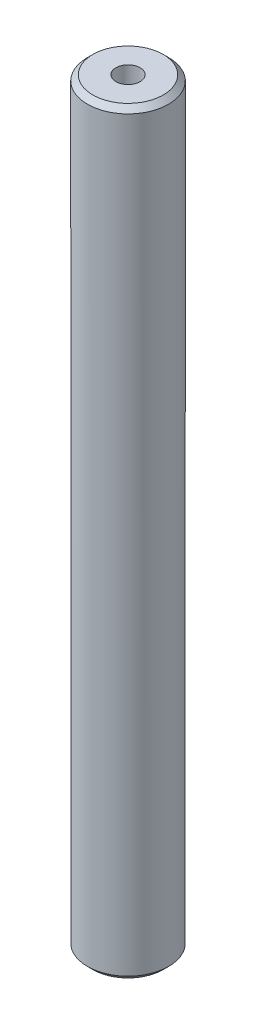
ISO-10303-21;
HEADER;
FILE_DESCRIPTION(('STEP AP214'),'2;1');
FILE_NAME('part.step','',(''),(''),'','','');
FILE_SCHEMA(('AUTOMOTIVE_DESIGN { 1 0 10303 214 1 1 1 1 }'));
ENDSEC;
DATA;
#1=APPLICATION_CONTEXT('core data for automotive mechanical design processes');
#2=APPLICATION_PROTOCOL_DEFINITION('international standard','automotive_design',2000,#1);
#3=PRODUCT_CONTEXT('',#1,'mechanical');
#4=PRODUCT('Part','Part','',(#3));
#5=PRODUCT_RELATED_PRODUCT_CATEGORY('part','',(#4));
#6=PRODUCT_DEFINITION_FORMATION('','',#4);
#7=PRODUCT_DEFINITION_CONTEXT('part definition',#1,'design');
#8=PRODUCT_DEFINITION('design','',#6,#7);
#9=PRODUCT_DEFINITION_SHAPE('','',#8);
#10=(LENGTH_UNIT() NAMED_UNIT(*) SI_UNIT(.MILLI.,.METRE.));
#11=(NAMED_UNIT(*) PLANE_ANGLE_UNIT() SI_UNIT($,.RADIAN.));
#12=(NAMED_UNIT(*) SI_UNIT($,.STERADIAN.) SOLID_ANGLE_UNIT());
#13=UNCERTAINTY_MEASURE_WITH_UNIT(LENGTH_MEASURE(1.E-05),#10,'distance_accuracy_value','');
#14=(GEOMETRIC_REPRESENTATION_CONTEXT(3) GLOBAL_UNCERTAINTY_ASSIGNED_CONTEXT((#13)) GLOBAL_UNIT_ASSIGNED_CONTEXT((#10,
#11,#12)) REPRESENTATION_CONTEXT('',''));
#15=CARTESIAN_POINT('',(0.,0.,0.));
#16=DIRECTION('',(0.,0.,1.));
#17=DIRECTION('',(1.,0.,0.));
#18=AXIS2_PLACEMENT_3D('',#15,#16,#17);
#19=CARTESIAN_POINT('',(0.,420.62093698399,0.));
#20=DIRECTION('',(0.,-1.,0.));
#21=DIRECTION('',(0.,0.,-1.));
#22=AXIS2_PLACEMENT_3D('',#19,#20,#21);
#23=CYLINDRICAL_SURFACE('',#22,22.5);
#24=CARTESIAN_POINT('',(0.,417.652403516235,0.));
#25=DIRECTION('',(0.,1.,0.));
#26=DIRECTION('',(0.,0.,1.));
#27=AXIS2_PLACEMENT_3D('',#24,#25,#26);
#28=CIRCLE('',#27,22.5);
#29=CARTESIAN_POINT('',(0.,417.652403516235,-22.5));
#30=VERTEX_POINT('',#29);
#31=EDGE_CURVE('E50',#30,#30,#28,.F.);
#32=CARTESIAN_POINT('',(0.,2.96853346775539,0.));
#33=DIRECTION('',(0.,1.,0.));
#34=DIRECTION('',(0.,0.,1.));
#35=AXIS2_PLACEMENT_3D('',#32,#33,#34);
#36=CIRCLE('',#35,22.5);
#37=CARTESIAN_POINT('',(0.,2.96853346775533,-22.5));
#38=VERTEX_POINT('',#37);
#39=EDGE_CURVE('E51',#38,#38,#36,.T.);
#40=CARTESIAN_POINT('',(0.,417.652403516235,-22.5));
#41=CARTESIAN_POINT('',(0.,413.332779869896,-22.5));
#42=CARTESIAN_POINT('',(0.,409.013156223558,-22.5));
#43=CARTESIAN_POINT('',(0.,400.373908930882,-22.5));
#44=CARTESIAN_POINT('',(0.,396.054285284543,-22.5));
#45=CARTESIAN_POINT('',(0.,387.415037991867,-22.5));
#46=CARTESIAN_POINT('',(0.,383.095414345528,-22.5));
#47=CARTESIAN_POINT('',(0.,374.456167052852,-22.5));
#48=CARTESIAN_POINT('',(0.,370.136543406513,-22.5));
#49=CARTESIAN_POINT('',(0.,361.497296113837,-22.5));
#50=CARTESIAN_POINT('',(0.,357.177672467498,-22.5));
#51=CARTESIAN_POINT('',(0.,348.538425174822,-22.5));
#52=CARTESIAN_POINT('',(0.,344.218801528483,-22.5));
#53=CARTESIAN_POINT('',(0.,335.579554235807,-22.5));
#54=CARTESIAN_POINT('',(0.,331.259930589468,-22.5));
#55=CARTESIAN_POINT('',(0.,322.620683296792,-22.5));
#56=CARTESIAN_POINT('',(0.,318.301059650453,-22.5));
#57=CARTESIAN_POINT('',(0.,309.661812357777,-22.5));
#58=CARTESIAN_POINT('',(0.,305.342188711438,-22.5));
#59=CARTESIAN_POINT('',(0.,296.702941418762,-22.5));
#60=CARTESIAN_POINT('',(0.,292.383317772423,-22.5));
#61=CARTESIAN_POINT('',(0.,283.744070479747,-22.5));
#62=CARTESIAN_POINT('',(0.,279.424446833408,-22.5));
#63=CARTESIAN_POINT('',(0.,270.785199540732,-22.5));
#64=CARTESIAN_POINT('',(0.,266.465575894393,-22.5));
#65=CARTESIAN_POINT('',(0.,257.826328601717,-22.5));
#66=CARTESIAN_POINT('',(0.,253.506704955378,-22.5));
#67=CARTESIAN_POINT('',(0.,244.867457662702,-22.5));
#68=CARTESIAN_POINT('',(0.,240.547834016363,-22.5));
#69=CARTESIAN_POINT('',(0.,231.908586723687,-22.5));
#70=CARTESIAN_POINT('',(0.,227.588963077348,-22.5));
#71=CARTESIAN_POINT('',(0.,218.949715784672,-22.5));
#72=CARTESIAN_POINT('',(0.,214.630092138333,-22.5));
#73=CARTESIAN_POINT('',(0.,205.990844845657,-22.5));
#74=CARTESIAN_POINT('',(0.,201.671221199318,-22.5));
#75=CARTESIAN_POINT('',(0.,193.031973906642,-22.5));
#76=CARTESIAN_POINT('',(0.,188.712350260303,-22.5));
#77=CARTESIAN_POINT('',(0.,180.073102967627,-22.5));
#78=CARTESIAN_POINT('',(0.,175.753479321288,-22.5));
#79=CARTESIAN_POINT('',(0.,167.114232028612,-22.5));
#80=CARTESIAN_POINT('',(0.,162.794608382273,-22.5));
#81=CARTESIAN_POINT('',(0.,154.155361089597,-22.5));
#82=CARTESIAN_POINT('',(0.,149.835737443258,-22.5));
#83=CARTESIAN_POINT('',(0.,141.196490150582,-22.5));
#84=CARTESIAN_POINT('',(0.,136.876866504243,-22.5));
#85=CARTESIAN_POINT('',(0.,128.237619211567,-22.5));
#86=CARTESIAN_POINT('',(0.,123.917995565228,-22.5));
#87=CARTESIAN_POINT('',(0.,115.278748272552,-22.5));
#88=CARTESIAN_POINT('',(0.,110.959124626214,-22.5));
#89=CARTESIAN_POINT('',(0.,102.319877333537,-22.5));
#90=CARTESIAN_POINT('',(0.,98.0002536871985,-22.5));
#91=CARTESIAN_POINT('',(0.,89.3610063945219,-22.5));
#92=CARTESIAN_POINT('',(0.,85.0413827481836,-22.5));
#93=CARTESIAN_POINT('',(0.,76.4021354555069,-22.5));
#94=CARTESIAN_POINT('',(0.,72.0825118091686,-22.5));
#95=CARTESIAN_POINT('',(0.,63.4432645164919,-22.5));
#96=CARTESIAN_POINT('',(0.,59.1236408701536,-22.5));
#97=CARTESIAN_POINT('',(0.,50.4843935774769,-22.5));
#98=CARTESIAN_POINT('',(0.,46.1647699311386,-22.5));
#99=CARTESIAN_POINT('',(0.,37.5255226384619,-22.5));
#100=CARTESIAN_POINT('',(0.,33.2058989921236,-22.5));
#101=CARTESIAN_POINT('',(0.,24.566651699447,-22.5));
#102=CARTESIAN_POINT('',(0.,20.2470280531086,-22.5));
#103=CARTESIAN_POINT('',(0.,11.607780760432,-22.5));
#104=CARTESIAN_POINT('',(0.,7.28815711409364,-22.5));
#105=CARTESIAN_POINT('',(0.,2.96853346775533,-22.5));
#106=B_SPLINE_CURVE_WITH_KNOTS('',3,(#40,#41,#42,#43,#44,#45,#46,#47,#48,#49,#50,#51,#52,#53,
#54,#55,#56,#57,#58,#59,#60,#61,#62,#63,#64,#65,#66,#67,#68,#69,#70,#71,#72,#73,#74,#75,#76,#77,
#78,#79,#80,#81,#82,#83,#84,#85,#86,#87,#88,#89,#90,#91,#92,#93,#94,#95,#96,#97,#98,#99,#100,
#101,#102,#103,#104,#105),.UNSPECIFIED.,.F.,.F.,(4,2,2,2,2,2,2,2,2,2,2,2,2,2,2,2,2,2,2,2,2,2,2,
2,2,2,2,2,2,2,2,2,4),(0.,12.9588709390149,25.9177418780299,38.8766128170449,51.8354837560599,
64.7943546950749,77.7532256340899,90.7120965731049,103.67096751212,116.629838451135,
129.58870939015,142.547580329165,155.50645126818,168.465322207195,181.42419314621,
194.383064085225,207.34193502424,220.300805963255,233.25967690227,246.218547841285,
259.1774187803,272.136289719315,285.09516065833,298.054031597345,311.01290253636,
323.971773475375,336.93064441439,349.889515353405,362.848386292419,375.807257231435,
388.766128170449,401.724999109465,414.683870048479),.UNSPECIFIED.);
#107=EDGE_CURVE('BSEAM39',#30,#38,#106,.T.);
#108=ORIENTED_EDGE('',*,*,#31,.T.);
#109=ORIENTED_EDGE('',*,*,#39,.T.);
#110=ORIENTED_EDGE('',*,*,#107,.T.);
#111=ORIENTED_EDGE('',*,*,#107,.F.);
#112=EDGE_LOOP('',(#108,#110,#109,#111));
#113=FACE_BOUND('',#112,.T.);
#114=ADVANCED_FACE('F39',(#113),#23,.T.);
#115=CARTESIAN_POINT('',(0.,420.62093698399,0.));
#116=DIRECTION('',(0.,1.,0.));
#117=DIRECTION('',(0.,0.,1.));
#118=AXIS2_PLACEMENT_3D('',#115,#116,#117);
#119=PLANE('',#118);
#120=CARTESIAN_POINT('',(0.,420.62093698399,0.));
#121=DIRECTION('',(0.,1.,0.));
#122=DIRECTION('',(0.,0.,1.));
#123=AXIS2_PLACEMENT_3D('',#120,#121,#122);
#124=CIRCLE('',#123,19.5314665322447);
#125=CARTESIAN_POINT('',(0.,420.62093698399,-19.5314665322447));
#126=VERTEX_POINT('',#125);
#127=EDGE_CURVE('E54',#126,#126,#124,.T.);
#128=ORIENTED_EDGE('',*,*,#127,.T.);
#129=EDGE_LOOP('',(#128));
#130=FACE_BOUND('',#129,.T.);
#131=CARTESIAN_POINT('',(0.,420.62093698399,0.));
#132=DIRECTION('',(0.,1.,0.));
#133=DIRECTION('',(0.,0.,1.));
#134=AXIS2_PLACEMENT_3D('',#131,#132,#133);
#135=CIRCLE('',#134,6.72766516371501);
#136=CARTESIAN_POINT('',(0.,420.62093698399,6.72766516371501));
#137=VERTEX_POINT('',#136);
#138=EDGE_CURVE('E58',#137,#137,#135,.T.);
#139=ORIENTED_EDGE('',*,*,#138,.F.);
#140=EDGE_LOOP('',(#139));
#141=FACE_BOUND('',#140,.T.);
#142=ADVANCED_FACE('F69',(#130,#141),#119,.T.);
#143=CARTESIAN_POINT('',(0.,0.,0.));
#144=DIRECTION('',(0.,1.,0.));
#145=DIRECTION('',(0.,0.,1.));
#146=AXIS2_PLACEMENT_3D('',#143,#144,#145);
#147=PLANE('',#146);
#148=CARTESIAN_POINT('',(0.,0.,0.));
#149=DIRECTION('',(0.,1.,0.));
#150=DIRECTION('',(0.,0.,1.));
#151=AXIS2_PLACEMENT_3D('',#148,#149,#150);
#152=CIRCLE('',#151,19.5314665322447);
#153=CARTESIAN_POINT('',(0.,0.,19.5314665322447));
#154=VERTEX_POINT('',#153);
#155=EDGE_CURVE('E10',#154,#154,#152,.F.);
#156=ORIENTED_EDGE('',*,*,#155,.T.);
#157=EDGE_LOOP('',(#156));
#158=FACE_BOUND('',#157,.T.);
#159=CARTESIAN_POINT('',(0.,0.,0.));
#160=DIRECTION('',(0.,1.,0.));
#161=DIRECTION('',(0.,0.,1.));
#162=AXIS2_PLACEMENT_3D('',#159,#160,#161);
#163=CIRCLE('',#162,6.72766516371501);
#164=CARTESIAN_POINT('',(0.,0.,6.72766516371501));
#165=VERTEX_POINT('',#164);
#166=EDGE_CURVE('E63',#165,#165,#163,.T.);
#167=ORIENTED_EDGE('',*,*,#166,.T.);
#168=EDGE_LOOP('',(#167));
#169=FACE_BOUND('',#168,.T.);
#170=ADVANCED_FACE('F75',(#158,#169),#147,.F.);
#171=CARTESIAN_POINT('',(0.,420.62093698399,0.));
#172=DIRECTION('',(0.,-1.,0.));
#173=DIRECTION('',(0.,0.,-1.));
#174=AXIS2_PLACEMENT_3D('',#171,#172,#173);
#175=CYLINDRICAL_SURFACE('',#174,6.72766516371501);
#176=ORIENTED_EDGE('',*,*,#138,.T.);
#177=EDGE_LOOP('',(#176));
#178=FACE_BOUND('',#177,.T.);
#179=ORIENTED_EDGE('',*,*,#166,.F.);
#180=EDGE_LOOP('',(#179));
#181=FACE_BOUND('',#180,.T.);
#182=ADVANCED_FACE('F70',(#178,#181),#175,.F.);
#183=CARTESIAN_POINT('',(0.,420.62093698399,0.));
#184=DIRECTION('',(0.,-1.,0.));
#185=DIRECTION('',(0.,0.,-1.));
#186=AXIS2_PLACEMENT_3D('',#183,#184,#185);
#187=CONICAL_SURFACE('',#186,19.5314665322447,0.785398163397436);
#188=CARTESIAN_POINT('',(0.,417.652403516235,-22.5));
#189=CARTESIAN_POINT('',(0.,417.683325739857,-22.4690777763776));
#190=CARTESIAN_POINT('',(0.,417.71424796348,-22.4381555527551));
#191=CARTESIAN_POINT('',(0.,417.776092410725,-22.3763111055102));
#192=CARTESIAN_POINT('',(0.,417.807014634347,-22.3453888818878));
#193=CARTESIAN_POINT('',(0.,417.868859081592,-22.2835444346429));
#194=CARTESIAN_POINT('',(0.,417.899781305214,-22.2526222110204));
#195=CARTESIAN_POINT('',(0.,417.961625752459,-22.1907777637755));
#196=CARTESIAN_POINT('',(0.,417.992547976082,-22.1598555401531));
#197=CARTESIAN_POINT('',(0.,418.054392423327,-22.0980110929082));
#198=CARTESIAN_POINT('',(0.,418.085314646949,-22.0670888692857));
#199=CARTESIAN_POINT('',(0.,418.147159094194,-22.0052444220408));
#200=CARTESIAN_POINT('',(0.,418.178081317817,-21.9743221984184));
#201=CARTESIAN_POINT('',(0.,418.239925765061,-21.9124777511735));
#202=CARTESIAN_POINT('',(0.,418.270847988684,-21.881555527551));
#203=CARTESIAN_POINT('',(0.,418.332692435929,-21.8197110803061));
#204=CARTESIAN_POINT('',(0.,418.363614659551,-21.7887888566837));
#205=CARTESIAN_POINT('',(0.,418.425459106796,-21.7269444094388));
#206=CARTESIAN_POINT('',(0.,418.456381330419,-21.6960221858163));
#207=CARTESIAN_POINT('',(0.,418.518225777663,-21.6341777385714));
#208=CARTESIAN_POINT('',(0.,418.549148001286,-21.603255514949));
#209=CARTESIAN_POINT('',(0.,418.610992448531,-21.5414110677041));
#210=CARTESIAN_POINT('',(0.,418.641914672153,-21.5104888440816));
#211=CARTESIAN_POINT('',(0.,418.703759119398,-21.4486443968367));
#212=CARTESIAN_POINT('',(0.,418.734681343021,-21.4177221732142));
#213=CARTESIAN_POINT('',(0.,418.796525790266,-21.3558777259693));
#214=CARTESIAN_POINT('',(0.,418.827448013888,-21.3249555023469));
#215=CARTESIAN_POINT('',(0.,418.889292461133,-21.263111055102));
#216=CARTESIAN_POINT('',(0.,418.920214684755,-21.2321888314795));
#217=CARTESIAN_POINT('',(0.,418.982059132,-21.1703443842346));
#218=CARTESIAN_POINT('',(0.,419.012981355623,-21.1394221606122));
#219=CARTESIAN_POINT('',(0.,419.074825802868,-21.0775777133673));
#220=CARTESIAN_POINT('',(0.,419.10574802649,-21.0466554897448));
#221=CARTESIAN_POINT('',(0.,419.167592473735,-20.9848110424999));
#222=CARTESIAN_POINT('',(0.,419.198514697357,-20.9538888188775));
#223=CARTESIAN_POINT('',(0.,419.260359144602,-20.8920443716326));
#224=CARTESIAN_POINT('',(0.,419.291281368225,-20.8611221480101));
#225=CARTESIAN_POINT('',(0.,419.35312581547,-20.7992777007652));
#226=CARTESIAN_POINT('',(0.,419.384048039092,-20.7683554771428));
#227=CARTESIAN_POINT('',(0.,419.445892486337,-20.7065110298979));
#228=CARTESIAN_POINT('',(0.,419.47681470996,-20.6755888062754));
#229=CARTESIAN_POINT('',(0.,419.538659157204,-20.6137443590305));
#230=CARTESIAN_POINT('',(0.,419.569581380827,-20.5828221354081));
#231=CARTESIAN_POINT('',(0.,419.631425828072,-20.5209776881631));
#232=CARTESIAN_POINT('',(0.,419.662348051694,-20.4900554645407));
#233=CARTESIAN_POINT('',(0.,419.724192498939,-20.4282110172958));
#234=CARTESIAN_POINT('',(0.,419.755114722562,-20.3972887936733));
#235=CARTESIAN_POINT('',(0.,419.816959169806,-20.3354443464284));
#236=CARTESIAN_POINT('',(0.,419.847881393429,-20.304522122806));
#237=CARTESIAN_POINT('',(0.,419.909725840674,-20.2426776755611));
#238=CARTESIAN_POINT('',(0.,419.940648064296,-20.2117554519386));
#239=CARTESIAN_POINT('',(0.,420.002492511541,-20.1499110046937));
#240=CARTESIAN_POINT('',(0.,420.033414735164,-20.1189887810713));
#241=CARTESIAN_POINT('',(0.,420.095259182409,-20.0571443338264));
#242=CARTESIAN_POINT('',(0.,420.126181406031,-20.0262221102039));
#243=CARTESIAN_POINT('',(0.,420.188025853276,-19.964377662959));
#244=CARTESIAN_POINT('',(0.,420.218948076898,-19.9334554393366));
#245=CARTESIAN_POINT('',(0.,420.280792524143,-19.8716109920917));
#246=CARTESIAN_POINT('',(0.,420.311714747766,-19.8406887684692));
#247=CARTESIAN_POINT('',(0.,420.373559195011,-19.7788443212243));
#248=CARTESIAN_POINT('',(0.,420.404481418633,-19.7479220976019));
#249=CARTESIAN_POINT('',(0.,420.466325865878,-19.686077650357));
#250=CARTESIAN_POINT('',(0.,420.4972480895,-19.6551554267345));
#251=CARTESIAN_POINT('',(0.,420.559092536745,-19.5933109794896));
#252=CARTESIAN_POINT('',(0.,420.590014760368,-19.5623887558672));
#253=CARTESIAN_POINT('',(0.,420.62093698399,-19.5314665322447));
#254=B_SPLINE_CURVE_WITH_KNOTS('',3,(#188,#189,#190,#191,#192,#193,#194,#195,#196,#197,#198,
#199,#200,#201,#202,#203,#204,#205,#206,#207,#208,#209,#210,#211,#212,#213,#214,#215,#216,#217,
#218,#219,#220,#221,#222,#223,#224,#225,#226,#227,#228,#229,#230,#231,#232,#233,#234,#235,#236,
#237,#238,#239,#240,#241,#242,#243,#244,#245,#246,#247,#248,#249,#250,#251,#252,#253),
.UNSPECIFIED.,.F.,.F.,(4,2,2,2,2,2,2,2,2,2,2,2,2,2,2,2,2,2,2,2,2,2,2,2,2,2,2,2,2,2,2,2,4),(0.,
0.131191884076794,0.262383768153629,0.393575652230422,0.524767536307255,0.655959420384051,
0.787151304460884,0.918343188537678,1.04953507261451,1.18072695669131,1.31191884076814,
1.44311072484494,1.57430260892177,1.70549449299856,1.8366863770754,1.96787826115219,
2.09907014522903,2.23026202930582,2.36145391338265,2.49264579745945,2.62383768153628,
2.75502956561307,2.88622144968991,3.0174133337667,3.14860521784354,3.27979710192033,
3.41098898599716,3.54218087007396,3.67337275415079,3.80456463822759,3.93575652230442,
4.06694840638122,4.19814029045805),.UNSPECIFIED.);
#255=EDGE_CURVE('BSEAM81',#30,#126,#254,.T.);
#256=ORIENTED_EDGE('',*,*,#31,.F.);
#257=ORIENTED_EDGE('',*,*,#127,.F.);
#258=ORIENTED_EDGE('',*,*,#255,.T.);
#259=ORIENTED_EDGE('',*,*,#255,.F.);
#260=EDGE_LOOP('',(#256,#258,#257,#259));
#261=FACE_BOUND('',#260,.T.);
#262=ADVANCED_FACE('F81',(#261),#187,.T.);
#263=CARTESIAN_POINT('',(0.,2.96853346775539,0.));
#264=DIRECTION('',(0.,1.,0.));
#265=DIRECTION('',(0.,0.,1.));
#266=AXIS2_PLACEMENT_3D('',#263,#264,#265);
#267=CONICAL_SURFACE('',#266,22.5,0.785398163397437);
#268=ORIENTED_EDGE('',*,*,#155,.F.);
#269=EDGE_LOOP('',(#268));
#270=FACE_BOUND('',#269,.T.);
#271=ORIENTED_EDGE('',*,*,#39,.F.);
#272=EDGE_LOOP('',(#271));
#273=FACE_BOUND('',#272,.T.);
#274=ADVANCED_FACE('F45',(#270,#273),#267,.T.);
#275=CLOSED_SHELL('',(#114,#142,#170,#182,#262,#274));
#276=MANIFOLD_SOLID_BREP('B2',#275);
#277=ADVANCED_BREP_SHAPE_REPRESENTATION('',(#18,#276),#14);
#278=SHAPE_DEFINITION_REPRESENTATION(#9,#277);
ENDSEC;
END-ISO-10303-21;
